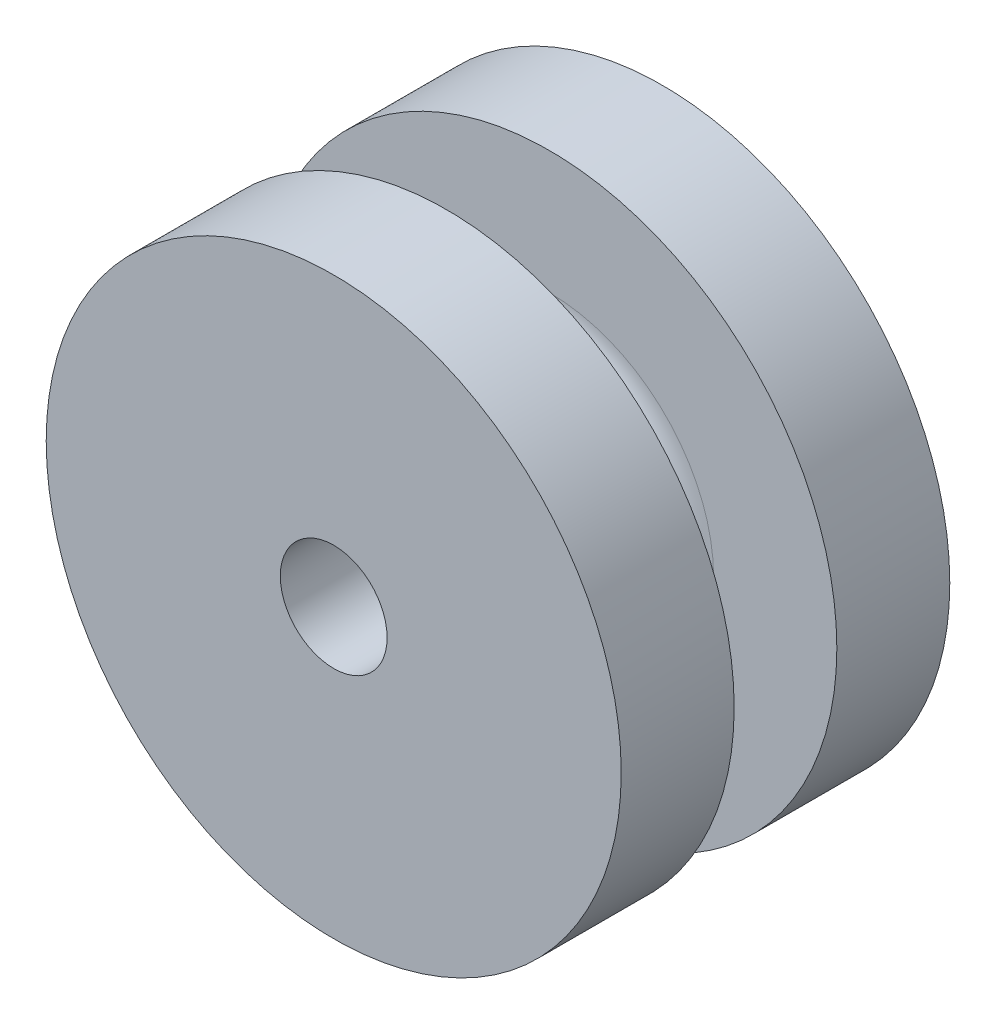
ISO-10303-21;
HEADER;
FILE_DESCRIPTION(('STEP AP214'),'2;1');
FILE_NAME('part.step','',(''),(''),'','','');
FILE_SCHEMA(('AUTOMOTIVE_DESIGN { 1 0 10303 214 1 1 1 1 }'));
ENDSEC;
DATA;
#1=APPLICATION_CONTEXT('core data for automotive mechanical design processes');
#2=APPLICATION_PROTOCOL_DEFINITION('international standard','automotive_design',2000,#1);
#3=PRODUCT_CONTEXT('',#1,'mechanical');
#4=PRODUCT('Part','Part','',(#3));
#5=PRODUCT_RELATED_PRODUCT_CATEGORY('part','',(#4));
#6=PRODUCT_DEFINITION_FORMATION('','',#4);
#7=PRODUCT_DEFINITION_CONTEXT('part definition',#1,'design');
#8=PRODUCT_DEFINITION('design','',#6,#7);
#9=PRODUCT_DEFINITION_SHAPE('','',#8);
#10=(LENGTH_UNIT() NAMED_UNIT(*) SI_UNIT(.MILLI.,.METRE.));
#11=(NAMED_UNIT(*) PLANE_ANGLE_UNIT() SI_UNIT($,.RADIAN.));
#12=(NAMED_UNIT(*) SI_UNIT($,.STERADIAN.) SOLID_ANGLE_UNIT());
#13=UNCERTAINTY_MEASURE_WITH_UNIT(LENGTH_MEASURE(1.E-05),#10,'distance_accuracy_value','');
#14=(GEOMETRIC_REPRESENTATION_CONTEXT(3) GLOBAL_UNCERTAINTY_ASSIGNED_CONTEXT((#13)) GLOBAL_UNIT_ASSIGNED_CONTEXT((#10,
#11,#12)) REPRESENTATION_CONTEXT('',''));
#15=CARTESIAN_POINT('',(0.,0.,0.));
#16=DIRECTION('',(0.,0.,1.));
#17=DIRECTION('',(1.,0.,0.));
#18=AXIS2_PLACEMENT_3D('',#15,#16,#17);
#19=CARTESIAN_POINT('',(0.,0.,8.));
#20=DIRECTION('',(0.,0.,-1.));
#21=DIRECTION('',(-1.,0.,0.));
#22=AXIS2_PLACEMENT_3D('',#19,#20,#21);
#23=CYLINDRICAL_SURFACE('',#22,7.);
#24=CARTESIAN_POINT('',(0.,0.,2.75));
#25=DIRECTION('',(0.,0.,-1.));
#26=DIRECTION('',(-1.,0.,0.));
#27=AXIS2_PLACEMENT_3D('',#24,#25,#26);
#28=CIRCLE('',#27,7.);
#29=CARTESIAN_POINT('',(-7.,0.,2.75));
#30=VERTEX_POINT('',#29);
#31=EDGE_CURVE('E55',#30,#30,#28,.T.);
#32=ORIENTED_EDGE('',*,*,#31,.T.);
#33=EDGE_LOOP('',(#32));
#34=FACE_BOUND('',#33,.T.);
#35=CARTESIAN_POINT('',(0.,0.,0.));
#36=DIRECTION('',(0.,0.,1.));
#37=DIRECTION('',(1.,0.,0.));
#38=AXIS2_PLACEMENT_3D('',#35,#36,#37);
#39=CIRCLE('',#38,7.);
#40=CARTESIAN_POINT('',(7.,0.,0.));
#41=VERTEX_POINT('',#40);
#42=EDGE_CURVE('E52',#41,#41,#39,.T.);
#43=ORIENTED_EDGE('',*,*,#42,.T.);
#44=EDGE_LOOP('',(#43));
#45=FACE_BOUND('',#44,.T.);
#46=ADVANCED_FACE('F31',(#34,#45),#23,.T.);
#47=CARTESIAN_POINT('',(0.,0.,0.));
#48=DIRECTION('',(0.,0.,1.));
#49=DIRECTION('',(1.,0.,0.));
#50=AXIS2_PLACEMENT_3D('',#47,#48,#49);
#51=PLANE('',#50);
#52=CARTESIAN_POINT('',(0.,0.,0.));
#53=DIRECTION('',(0.,0.,-1.));
#54=DIRECTION('',(-1.,0.,0.));
#55=AXIS2_PLACEMENT_3D('',#52,#53,#54);
#56=CIRCLE('',#55,1.3);
#57=CARTESIAN_POINT('',(-1.3,0.,0.));
#58=VERTEX_POINT('',#57);
#59=EDGE_CURVE('E63',#58,#58,#56,.T.);
#60=ORIENTED_EDGE('',*,*,#59,.F.);
#61=EDGE_LOOP('',(#60));
#62=FACE_BOUND('',#61,.T.);
#63=ORIENTED_EDGE('',*,*,#42,.F.);
#64=EDGE_LOOP('',(#63));
#65=FACE_BOUND('',#64,.T.);
#66=ADVANCED_FACE('F72',(#62,#65),#51,.F.);
#67=CARTESIAN_POINT('',(0.,0.,2.75));
#68=DIRECTION('',(0.,0.,-1.));
#69=DIRECTION('',(-1.,0.,0.));
#70=AXIS2_PLACEMENT_3D('',#67,#68,#69);
#71=PLANE('',#70);
#72=CARTESIAN_POINT('',(0.,0.,2.75));
#73=DIRECTION('',(0.,0.,-1.));
#74=DIRECTION('',(-1.,0.,0.));
#75=AXIS2_PLACEMENT_3D('',#72,#73,#74);
#76=CIRCLE('',#75,4.);
#77=CARTESIAN_POINT('',(-4.,0.,2.75));
#78=VERTEX_POINT('',#77);
#79=EDGE_CURVE('E46',#78,#78,#76,.T.);
#80=ORIENTED_EDGE('',*,*,#79,.T.);
#81=EDGE_LOOP('',(#80));
#82=FACE_BOUND('',#81,.T.);
#83=ORIENTED_EDGE('',*,*,#31,.F.);
#84=EDGE_LOOP('',(#83));
#85=FACE_BOUND('',#84,.T.);
#86=ADVANCED_FACE('F75',(#82,#85),#71,.F.);
#87=CARTESIAN_POINT('',(0.,0.,2.75));
#88=DIRECTION('',(0.,0.,1.));
#89=DIRECTION('',(1.,0.,0.));
#90=AXIS2_PLACEMENT_3D('',#87,#88,#89);
#91=CYLINDRICAL_SURFACE('',#90,3.);
#92=CARTESIAN_POINT('',(0.,0.,3.75));
#93=DIRECTION('',(0.,0.,-1.));
#94=DIRECTION('',(-1.,0.,0.));
#95=AXIS2_PLACEMENT_3D('',#92,#93,#94);
#96=CIRCLE('',#95,3.);
#97=CARTESIAN_POINT('',(-3.,0.,3.75));
#98=VERTEX_POINT('',#97);
#99=EDGE_CURVE('E38',#98,#98,#96,.F.);
#100=ORIENTED_EDGE('',*,*,#99,.T.);
#101=EDGE_LOOP('',(#100));
#102=FACE_BOUND('',#101,.T.);
#103=CARTESIAN_POINT('',(0.,0.,4.25));
#104=DIRECTION('',(0.,0.,-1.));
#105=DIRECTION('',(-1.,0.,0.));
#106=AXIS2_PLACEMENT_3D('',#103,#104,#105);
#107=CIRCLE('',#106,3.);
#108=CARTESIAN_POINT('',(-3.,0.,4.25));
#109=VERTEX_POINT('',#108);
#110=EDGE_CURVE('E42',#109,#109,#107,.T.);
#111=ORIENTED_EDGE('',*,*,#110,.T.);
#112=EDGE_LOOP('',(#111));
#113=FACE_BOUND('',#112,.T.);
#114=ADVANCED_FACE('F102',(#102,#113),#91,.T.);
#115=CARTESIAN_POINT('',(0.,0.,5.25));
#116=DIRECTION('',(0.,0.,-1.));
#117=DIRECTION('',(-1.,0.,0.));
#118=AXIS2_PLACEMENT_3D('',#115,#116,#117);
#119=PLANE('',#118);
#120=CARTESIAN_POINT('',(0.,0.,5.25));
#121=DIRECTION('',(0.,0.,-1.));
#122=DIRECTION('',(-1.,0.,0.));
#123=AXIS2_PLACEMENT_3D('',#120,#121,#122);
#124=CIRCLE('',#123,4.);
#125=CARTESIAN_POINT('',(-4.,0.,5.25));
#126=VERTEX_POINT('',#125);
#127=EDGE_CURVE('E10',#126,#126,#124,.F.);
#128=ORIENTED_EDGE('',*,*,#127,.T.);
#129=EDGE_LOOP('',(#128));
#130=FACE_BOUND('',#129,.T.);
#131=CARTESIAN_POINT('',(0.,0.,5.25));
#132=DIRECTION('',(0.,0.,-1.));
#133=DIRECTION('',(-1.,0.,0.));
#134=AXIS2_PLACEMENT_3D('',#131,#132,#133);
#135=CIRCLE('',#134,7.);
#136=CARTESIAN_POINT('',(-7.,0.,5.25));
#137=VERTEX_POINT('',#136);
#138=EDGE_CURVE('E60',#137,#137,#135,.T.);
#139=ORIENTED_EDGE('',*,*,#138,.T.);
#140=EDGE_LOOP('',(#139));
#141=FACE_BOUND('',#140,.T.);
#142=ADVANCED_FACE('F94',(#130,#141),#119,.T.);
#143=CARTESIAN_POINT('',(0.,0.,8.));
#144=DIRECTION('',(0.,0.,1.));
#145=DIRECTION('',(1.,0.,0.));
#146=AXIS2_PLACEMENT_3D('',#143,#144,#145);
#147=PLANE('',#146);
#148=CARTESIAN_POINT('',(0.,0.,8.));
#149=DIRECTION('',(0.,0.,1.));
#150=DIRECTION('',(1.,0.,0.));
#151=AXIS2_PLACEMENT_3D('',#148,#149,#150);
#152=CIRCLE('',#151,1.3);
#153=CARTESIAN_POINT('',(1.3,0.,8.));
#154=VERTEX_POINT('',#153);
#155=EDGE_CURVE('E64',#154,#154,#152,.F.);
#156=ORIENTED_EDGE('',*,*,#155,.T.);
#157=EDGE_LOOP('',(#156));
#158=FACE_BOUND('',#157,.T.);
#159=CARTESIAN_POINT('',(0.,0.,8.));
#160=DIRECTION('',(0.,0.,1.));
#161=DIRECTION('',(1.,0.,0.));
#162=AXIS2_PLACEMENT_3D('',#159,#160,#161);
#163=CIRCLE('',#162,7.);
#164=CARTESIAN_POINT('',(7.,0.,8.));
#165=VERTEX_POINT('',#164);
#166=EDGE_CURVE('E51',#165,#165,#163,.T.);
#167=ORIENTED_EDGE('',*,*,#166,.T.);
#168=EDGE_LOOP('',(#167));
#169=FACE_BOUND('',#168,.T.);
#170=ADVANCED_FACE('F87',(#158,#169),#147,.T.);
#171=ORIENTED_EDGE('',*,*,#166,.F.);
#172=EDGE_LOOP('',(#171));
#173=FACE_BOUND('',#172,.T.);
#174=ORIENTED_EDGE('',*,*,#138,.F.);
#175=EDGE_LOOP('',(#174));
#176=FACE_BOUND('',#175,.T.);
#177=ADVANCED_FACE('F82',(#173,#176),#23,.T.);
#178=CARTESIAN_POINT('',(0.,0.,3.75));
#179=DIRECTION('',(0.,0.,-1.));
#180=DIRECTION('',(-1.,0.,0.));
#181=AXIS2_PLACEMENT_3D('',#178,#179,#180);
#182=TOROIDAL_SURFACE('',#181,4.,1.);
#183=ORIENTED_EDGE('',*,*,#99,.F.);
#184=EDGE_LOOP('',(#183));
#185=FACE_BOUND('',#184,.T.);
#186=ORIENTED_EDGE('',*,*,#79,.F.);
#187=EDGE_LOOP('',(#186));
#188=FACE_BOUND('',#187,.T.);
#189=ADVANCED_FACE('F86',(#185,#188),#182,.F.);
#190=CARTESIAN_POINT('',(0.,0.,4.25));
#191=DIRECTION('',(0.,0.,-1.));
#192=DIRECTION('',(-1.,0.,0.));
#193=AXIS2_PLACEMENT_3D('',#190,#191,#192);
#194=TOROIDAL_SURFACE('',#193,4.,1.);
#195=ORIENTED_EDGE('',*,*,#127,.F.);
#196=EDGE_LOOP('',(#195));
#197=FACE_BOUND('',#196,.T.);
#198=ORIENTED_EDGE('',*,*,#110,.F.);
#199=EDGE_LOOP('',(#198));
#200=FACE_BOUND('',#199,.T.);
#201=ADVANCED_FACE('F33',(#197,#200),#194,.F.);
#202=CARTESIAN_POINT('',(0.,0.,8.001));
#203=DIRECTION('',(0.,0.,-1.));
#204=DIRECTION('',(-1.,0.,0.));
#205=AXIS2_PLACEMENT_3D('',#202,#203,#204);
#206=CYLINDRICAL_SURFACE('',#205,1.3);
#207=ORIENTED_EDGE('',*,*,#155,.F.);
#208=EDGE_LOOP('',(#207));
#209=FACE_BOUND('',#208,.T.);
#210=ORIENTED_EDGE('',*,*,#59,.T.);
#211=EDGE_LOOP('',(#210));
#212=FACE_BOUND('',#211,.T.);
#213=ADVANCED_FACE('F70',(#209,#212),#206,.F.);
#214=CLOSED_SHELL('',(#46,#66,#86,#114,#142,#170,#177,#189,#201,#213));
#215=MANIFOLD_SOLID_BREP('B2',#214);
#216=ADVANCED_BREP_SHAPE_REPRESENTATION('',(#18,#215),#14);
#217=SHAPE_DEFINITION_REPRESENTATION(#9,#216);
ENDSEC;
END-ISO-10303-21;
